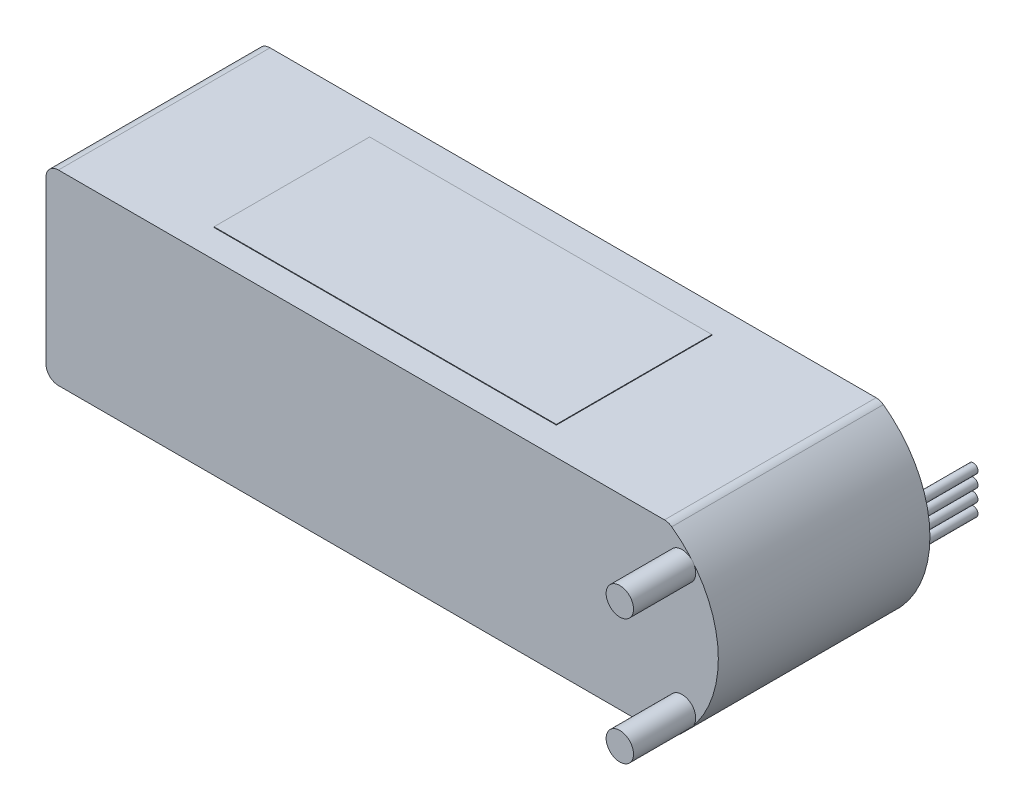
ISO-10303-21;
HEADER;
FILE_DESCRIPTION(('STEP AP214'),'2;1');
FILE_NAME('part.step','',(''),(''),'','','');
FILE_SCHEMA(('AUTOMOTIVE_DESIGN { 1 0 10303 214 1 1 1 1 }'));
ENDSEC;
DATA;
#1=APPLICATION_CONTEXT('core data for automotive mechanical design processes');
#2=APPLICATION_PROTOCOL_DEFINITION('international standard','automotive_design',2000,#1);
#3=PRODUCT_CONTEXT('',#1,'mechanical');
#4=PRODUCT('Part','Part','',(#3));
#5=PRODUCT_RELATED_PRODUCT_CATEGORY('part','',(#4));
#6=PRODUCT_DEFINITION_FORMATION('','',#4);
#7=PRODUCT_DEFINITION_CONTEXT('part definition',#1,'design');
#8=PRODUCT_DEFINITION('design','',#6,#7);
#9=PRODUCT_DEFINITION_SHAPE('','',#8);
#10=(LENGTH_UNIT() NAMED_UNIT(*) SI_UNIT(.MILLI.,.METRE.));
#11=(NAMED_UNIT(*) PLANE_ANGLE_UNIT() SI_UNIT($,.RADIAN.));
#12=(NAMED_UNIT(*) SI_UNIT($,.STERADIAN.) SOLID_ANGLE_UNIT());
#13=UNCERTAINTY_MEASURE_WITH_UNIT(LENGTH_MEASURE(1.E-05),#10,'distance_accuracy_value','');
#14=(GEOMETRIC_REPRESENTATION_CONTEXT(3) GLOBAL_UNCERTAINTY_ASSIGNED_CONTEXT((#13)) GLOBAL_UNIT_ASSIGNED_CONTEXT((#10,
#11,#12)) REPRESENTATION_CONTEXT('',''));
#15=CARTESIAN_POINT('',(0.,0.,0.));
#16=DIRECTION('',(0.,0.,1.));
#17=DIRECTION('',(1.,0.,0.));
#18=AXIS2_PLACEMENT_3D('',#15,#16,#17);
#19=CARTESIAN_POINT('',(55.,-3.00000000000001,-27.));
#20=DIRECTION('',(0.,0.,1.));
#21=DIRECTION('',(1.,0.,0.));
#22=AXIS2_PLACEMENT_3D('',#19,#20,#21);
#23=CYLINDRICAL_SURFACE('',#22,0.749999999999999);
#24=CARTESIAN_POINT('',(55.,-3.00000000000001,-27.));
#25=DIRECTION('',(0.,0.,-1.));
#26=DIRECTION('',(1.,0.,0.));
#27=AXIS2_PLACEMENT_3D('',#24,#25,#26);
#28=CIRCLE('',#27,0.749999999999999);
#29=CARTESIAN_POINT('',(55.75,-3.00000000000001,-27.));
#30=VERTEX_POINT('',#29);
#31=EDGE_CURVE('E11',#30,#30,#28,.T.);
#32=ORIENTED_EDGE('',*,*,#31,.F.);
#33=EDGE_LOOP('',(#32));
#34=FACE_BOUND('',#33,.T.);
#35=CARTESIAN_POINT('',(55.,-3.00000000000001,-17.));
#36=DIRECTION('',(0.,0.,-1.));
#37=DIRECTION('',(1.,0.,0.));
#38=AXIS2_PLACEMENT_3D('',#35,#36,#37);
#39=CIRCLE('',#38,0.749999999999999);
#40=CARTESIAN_POINT('',(55.75,-3.00000000000001,-17.));
#41=VERTEX_POINT('',#40);
#42=EDGE_CURVE('E46',#41,#41,#39,.T.);
#43=ORIENTED_EDGE('',*,*,#42,.T.);
#44=EDGE_LOOP('',(#43));
#45=FACE_BOUND('',#44,.T.);
#46=ADVANCED_FACE('F43',(#34,#45),#23,.T.);
#47=CARTESIAN_POINT('',(55.,-3.00000000000001,-27.));
#48=DIRECTION('',(0.,0.,1.));
#49=DIRECTION('',(1.,0.,0.));
#50=AXIS2_PLACEMENT_3D('',#47,#48,#49);
#51=PLANE('',#50);
#52=ORIENTED_EDGE('',*,*,#31,.T.);
#53=EDGE_LOOP('',(#52));
#54=FACE_BOUND('',#53,.T.);
#55=ADVANCED_FACE('F58',(#54),#51,.F.);
#56=CARTESIAN_POINT('',(55.,-3.00000000000001,-17.));
#57=DIRECTION('',(0.,0.,1.));
#58=DIRECTION('',(1.,0.,0.));
#59=AXIS2_PLACEMENT_3D('',#56,#57,#58);
#60=PLANE('',#59);
#61=ORIENTED_EDGE('',*,*,#42,.F.);
#62=EDGE_LOOP('',(#61));
#63=FACE_BOUND('',#62,.T.);
#64=ADVANCED_FACE('F56',(#63),#60,.T.);
#65=CLOSED_SHELL('',(#46,#55,#64));
#66=MANIFOLD_SOLID_BREP('B2',#65);
#67=CARTESIAN_POINT('',(55.,0.999999999999992,-27.));
#68=DIRECTION('',(0.,0.,1.));
#69=DIRECTION('',(1.,0.,0.));
#70=AXIS2_PLACEMENT_3D('',#67,#68,#69);
#71=CYLINDRICAL_SURFACE('',#70,0.749999999999999);
#72=CARTESIAN_POINT('',(55.,0.999999999999992,-27.));
#73=DIRECTION('',(0.,0.,-1.));
#74=DIRECTION('',(-1.,0.,0.));
#75=AXIS2_PLACEMENT_3D('',#72,#73,#74);
#76=CIRCLE('',#75,0.749999999999999);
#77=CARTESIAN_POINT('',(54.25,0.999999999999992,-27.));
#78=VERTEX_POINT('',#77);
#79=EDGE_CURVE('E42',#78,#78,#76,.T.);
#80=ORIENTED_EDGE('',*,*,#79,.F.);
#81=EDGE_LOOP('',(#80));
#82=FACE_BOUND('',#81,.T.);
#83=CARTESIAN_POINT('',(55.,0.999999999999992,-17.));
#84=DIRECTION('',(0.,0.,-1.));
#85=DIRECTION('',(-1.,0.,0.));
#86=AXIS2_PLACEMENT_3D('',#83,#84,#85);
#87=CIRCLE('',#86,0.749999999999999);
#88=CARTESIAN_POINT('',(54.25,0.999999999999992,-17.));
#89=VERTEX_POINT('',#88);
#90=EDGE_CURVE('E113',#89,#89,#87,.T.);
#91=ORIENTED_EDGE('',*,*,#90,.T.);
#92=EDGE_LOOP('',(#91));
#93=FACE_BOUND('',#92,.T.);
#94=ADVANCED_FACE('F110',(#82,#93),#71,.T.);
#95=CARTESIAN_POINT('',(55.,0.999999999999992,-27.));
#96=DIRECTION('',(0.,0.,-1.));
#97=DIRECTION('',(-1.,0.,0.));
#98=AXIS2_PLACEMENT_3D('',#95,#96,#97);
#99=PLANE('',#98);
#100=ORIENTED_EDGE('',*,*,#79,.T.);
#101=EDGE_LOOP('',(#100));
#102=FACE_BOUND('',#101,.T.);
#103=ADVANCED_FACE('F125',(#102),#99,.T.);
#104=CARTESIAN_POINT('',(55.,0.999999999999992,-17.));
#105=DIRECTION('',(0.,0.,-1.));
#106=DIRECTION('',(-1.,0.,0.));
#107=AXIS2_PLACEMENT_3D('',#104,#105,#106);
#108=PLANE('',#107);
#109=ORIENTED_EDGE('',*,*,#90,.F.);
#110=EDGE_LOOP('',(#109));
#111=FACE_BOUND('',#110,.T.);
#112=ADVANCED_FACE('F123',(#111),#108,.F.);
#113=CLOSED_SHELL('',(#94,#103,#112));
#114=MANIFOLD_SOLID_BREP('B6',#113);
#115=CARTESIAN_POINT('',(55.,-1.00000000000001,-27.));
#116=DIRECTION('',(0.,0.,1.));
#117=DIRECTION('',(1.,0.,0.));
#118=AXIS2_PLACEMENT_3D('',#115,#116,#117);
#119=CYLINDRICAL_SURFACE('',#118,0.749999999999999);
#120=CARTESIAN_POINT('',(55.,-1.00000000000001,-27.));
#121=DIRECTION('',(0.,0.,-1.));
#122=DIRECTION('',(1.,0.,0.));
#123=AXIS2_PLACEMENT_3D('',#120,#121,#122);
#124=CIRCLE('',#123,0.749999999999999);
#125=CARTESIAN_POINT('',(55.75,-1.00000000000001,-27.));
#126=VERTEX_POINT('',#125);
#127=EDGE_CURVE('E109',#126,#126,#124,.T.);
#128=ORIENTED_EDGE('',*,*,#127,.F.);
#129=EDGE_LOOP('',(#128));
#130=FACE_BOUND('',#129,.T.);
#131=CARTESIAN_POINT('',(55.,-1.00000000000001,-17.));
#132=DIRECTION('',(0.,0.,-1.));
#133=DIRECTION('',(1.,0.,0.));
#134=AXIS2_PLACEMENT_3D('',#131,#132,#133);
#135=CIRCLE('',#134,0.749999999999999);
#136=CARTESIAN_POINT('',(55.75,-1.00000000000001,-17.));
#137=VERTEX_POINT('',#136);
#138=EDGE_CURVE('E180',#137,#137,#135,.T.);
#139=ORIENTED_EDGE('',*,*,#138,.T.);
#140=EDGE_LOOP('',(#139));
#141=FACE_BOUND('',#140,.T.);
#142=ADVANCED_FACE('F177',(#130,#141),#119,.T.);
#143=CARTESIAN_POINT('',(55.,-1.00000000000001,-27.));
#144=DIRECTION('',(0.,0.,1.));
#145=DIRECTION('',(1.,0.,0.));
#146=AXIS2_PLACEMENT_3D('',#143,#144,#145);
#147=PLANE('',#146);
#148=ORIENTED_EDGE('',*,*,#127,.T.);
#149=EDGE_LOOP('',(#148));
#150=FACE_BOUND('',#149,.T.);
#151=ADVANCED_FACE('F192',(#150),#147,.F.);
#152=CARTESIAN_POINT('',(55.,-1.00000000000001,-17.));
#153=DIRECTION('',(0.,0.,1.));
#154=DIRECTION('',(1.,0.,0.));
#155=AXIS2_PLACEMENT_3D('',#152,#153,#154);
#156=PLANE('',#155);
#157=ORIENTED_EDGE('',*,*,#138,.F.);
#158=EDGE_LOOP('',(#157));
#159=FACE_BOUND('',#158,.T.);
#160=ADVANCED_FACE('F190',(#159),#156,.T.);
#161=CLOSED_SHELL('',(#142,#151,#160));
#162=MANIFOLD_SOLID_BREP('B37',#161);
#163=CARTESIAN_POINT('',(55.,2.99999999999999,-27.));
#164=DIRECTION('',(0.,0.,1.));
#165=DIRECTION('',(1.,0.,0.));
#166=AXIS2_PLACEMENT_3D('',#163,#164,#165);
#167=CYLINDRICAL_SURFACE('',#166,0.749999999999999);
#168=CARTESIAN_POINT('',(55.,2.99999999999999,-27.));
#169=DIRECTION('',(0.,0.,-1.));
#170=DIRECTION('',(-1.,0.,0.));
#171=AXIS2_PLACEMENT_3D('',#168,#169,#170);
#172=CIRCLE('',#171,0.749999999999999);
#173=CARTESIAN_POINT('',(54.25,2.99999999999999,-27.));
#174=VERTEX_POINT('',#173);
#175=EDGE_CURVE('E176',#174,#174,#172,.T.);
#176=ORIENTED_EDGE('',*,*,#175,.F.);
#177=EDGE_LOOP('',(#176));
#178=FACE_BOUND('',#177,.T.);
#179=CARTESIAN_POINT('',(55.,2.99999999999999,-17.));
#180=DIRECTION('',(0.,0.,-1.));
#181=DIRECTION('',(-1.,0.,0.));
#182=AXIS2_PLACEMENT_3D('',#179,#180,#181);
#183=CIRCLE('',#182,0.749999999999999);
#184=CARTESIAN_POINT('',(54.25,2.99999999999999,-17.));
#185=VERTEX_POINT('',#184);
#186=EDGE_CURVE('E247',#185,#185,#183,.T.);
#187=ORIENTED_EDGE('',*,*,#186,.T.);
#188=EDGE_LOOP('',(#187));
#189=FACE_BOUND('',#188,.T.);
#190=ADVANCED_FACE('F244',(#178,#189),#167,.T.);
#191=CARTESIAN_POINT('',(55.,2.99999999999999,-27.));
#192=DIRECTION('',(0.,0.,-1.));
#193=DIRECTION('',(-1.,0.,0.));
#194=AXIS2_PLACEMENT_3D('',#191,#192,#193);
#195=PLANE('',#194);
#196=ORIENTED_EDGE('',*,*,#175,.T.);
#197=EDGE_LOOP('',(#196));
#198=FACE_BOUND('',#197,.T.);
#199=ADVANCED_FACE('F259',(#198),#195,.T.);
#200=CARTESIAN_POINT('',(55.,2.99999999999999,-17.));
#201=DIRECTION('',(0.,0.,-1.));
#202=DIRECTION('',(-1.,0.,0.));
#203=AXIS2_PLACEMENT_3D('',#200,#201,#202);
#204=PLANE('',#203);
#205=ORIENTED_EDGE('',*,*,#186,.F.);
#206=EDGE_LOOP('',(#205));
#207=FACE_BOUND('',#206,.T.);
#208=ADVANCED_FACE('F257',(#207),#204,.F.);
#209=CLOSED_SHELL('',(#190,#199,#208));
#210=MANIFOLD_SOLID_BREP('B104',#209);
#211=CARTESIAN_POINT('',(52.2,-10.0835446118809,27.));
#212=DIRECTION('',(0.,0.,-1.));
#213=DIRECTION('',(-1.,0.,0.));
#214=AXIS2_PLACEMENT_3D('',#211,#212,#213);
#215=CYLINDRICAL_SURFACE('',#214,2.2);
#216=CARTESIAN_POINT('',(52.2,-10.0835446118809,27.));
#217=DIRECTION('',(0.,0.,1.));
#218=DIRECTION('',(-1.,0.,0.));
#219=AXIS2_PLACEMENT_3D('',#216,#217,#218);
#220=CIRCLE('',#219,2.2);
#221=CARTESIAN_POINT('',(50.,-10.0835446118809,27.));
#222=VERTEX_POINT('',#221);
#223=EDGE_CURVE('E243',#222,#222,#220,.T.);
#224=ORIENTED_EDGE('',*,*,#223,.F.);
#225=EDGE_LOOP('',(#224));
#226=FACE_BOUND('',#225,.T.);
#227=CARTESIAN_POINT('',(52.2,-10.0835446118809,17.));
#228=DIRECTION('',(0.,0.,1.));
#229=DIRECTION('',(-1.,0.,0.));
#230=AXIS2_PLACEMENT_3D('',#227,#228,#229);
#231=CIRCLE('',#230,2.2);
#232=CARTESIAN_POINT('',(50.,-10.0835446118809,17.));
#233=VERTEX_POINT('',#232);
#234=EDGE_CURVE('E314',#233,#233,#231,.T.);
#235=ORIENTED_EDGE('',*,*,#234,.T.);
#236=EDGE_LOOP('',(#235));
#237=FACE_BOUND('',#236,.T.);
#238=ADVANCED_FACE('F311',(#226,#237),#215,.T.);
#239=CARTESIAN_POINT('',(52.2,-10.0835446118809,27.));
#240=DIRECTION('',(0.,0.,-1.));
#241=DIRECTION('',(-1.,0.,0.));
#242=AXIS2_PLACEMENT_3D('',#239,#240,#241);
#243=PLANE('',#242);
#244=ORIENTED_EDGE('',*,*,#223,.T.);
#245=EDGE_LOOP('',(#244));
#246=FACE_BOUND('',#245,.T.);
#247=ADVANCED_FACE('F326',(#246),#243,.F.);
#248=CARTESIAN_POINT('',(52.2,-10.0835446118809,17.));
#249=DIRECTION('',(0.,0.,-1.));
#250=DIRECTION('',(-1.,0.,0.));
#251=AXIS2_PLACEMENT_3D('',#248,#249,#250);
#252=PLANE('',#251);
#253=ORIENTED_EDGE('',*,*,#234,.F.);
#254=EDGE_LOOP('',(#253));
#255=FACE_BOUND('',#254,.T.);
#256=ADVANCED_FACE('F324',(#255),#252,.T.);
#257=CLOSED_SHELL('',(#238,#247,#256));
#258=MANIFOLD_SOLID_BREP('B171',#257);
#259=CARTESIAN_POINT('',(52.2,10.0835446118809,27.));
#260=DIRECTION('',(0.,0.,-1.));
#261=DIRECTION('',(-1.,0.,0.));
#262=AXIS2_PLACEMENT_3D('',#259,#260,#261);
#263=CYLINDRICAL_SURFACE('',#262,2.2);
#264=CARTESIAN_POINT('',(52.2,10.0835446118809,27.));
#265=DIRECTION('',(0.,0.,1.));
#266=DIRECTION('',(1.,0.,0.));
#267=AXIS2_PLACEMENT_3D('',#264,#265,#266);
#268=CIRCLE('',#267,2.2);
#269=CARTESIAN_POINT('',(54.4,10.0835446118809,27.));
#270=VERTEX_POINT('',#269);
#271=EDGE_CURVE('E310',#270,#270,#268,.T.);
#272=ORIENTED_EDGE('',*,*,#271,.F.);
#273=EDGE_LOOP('',(#272));
#274=FACE_BOUND('',#273,.T.);
#275=CARTESIAN_POINT('',(52.2,10.0835446118809,17.));
#276=DIRECTION('',(0.,0.,1.));
#277=DIRECTION('',(1.,0.,0.));
#278=AXIS2_PLACEMENT_3D('',#275,#276,#277);
#279=CIRCLE('',#278,2.2);
#280=CARTESIAN_POINT('',(54.4,10.0835446118809,17.));
#281=VERTEX_POINT('',#280);
#282=EDGE_CURVE('E382',#281,#281,#279,.T.);
#283=ORIENTED_EDGE('',*,*,#282,.T.);
#284=EDGE_LOOP('',(#283));
#285=FACE_BOUND('',#284,.T.);
#286=ADVANCED_FACE('F379',(#274,#285),#263,.T.);
#287=CARTESIAN_POINT('',(52.2,10.0835446118809,27.));
#288=DIRECTION('',(0.,0.,1.));
#289=DIRECTION('',(1.,0.,0.));
#290=AXIS2_PLACEMENT_3D('',#287,#288,#289);
#291=PLANE('',#290);
#292=ORIENTED_EDGE('',*,*,#271,.T.);
#293=EDGE_LOOP('',(#292));
#294=FACE_BOUND('',#293,.T.);
#295=ADVANCED_FACE('F394',(#294),#291,.T.);
#296=CARTESIAN_POINT('',(52.2,10.0835446118809,17.));
#297=DIRECTION('',(0.,0.,1.));
#298=DIRECTION('',(1.,0.,0.));
#299=AXIS2_PLACEMENT_3D('',#296,#297,#298);
#300=PLANE('',#299);
#301=ORIENTED_EDGE('',*,*,#282,.F.);
#302=EDGE_LOOP('',(#301));
#303=FACE_BOUND('',#302,.T.);
#304=ADVANCED_FACE('F392',(#303),#300,.F.);
#305=CLOSED_SHELL('',(#286,#295,#304));
#306=MANIFOLD_SOLID_BREP('B238',#305);
#307=CARTESIAN_POINT('',(-50.,15.,17.));
#308=DIRECTION('',(0.,-1.,0.));
#309=DIRECTION('',(0.,0.,-1.));
#310=AXIS2_PLACEMENT_3D('',#307,#308,#309);
#311=PLANE('',#310);
#312=DIRECTION('',(-1.,0.,0.));
#313=VECTOR('',#312,1.);
#314=CARTESIAN_POINT('',(-50.,15.,17.));
#315=LINE('',#314,#313);
#316=CARTESIAN_POINT('',(49.3749119724252,15.,17.));
#317=VERTEX_POINT('',#316);
#318=CARTESIAN_POINT('',(-48.,15.,17.));
#319=VERTEX_POINT('',#318);
#320=EDGE_CURVE('E564',#317,#319,#315,.T.);
#321=ORIENTED_EDGE('',*,*,#320,.F.);
#322=DIRECTION('',(0.,0.,-1.));
#323=VECTOR('',#322,1.);
#324=CARTESIAN_POINT('',(49.3749119724252,15.,17.));
#325=LINE('',#324,#323);
#326=CARTESIAN_POINT('',(49.3749119724252,15.,-17.));
#327=VERTEX_POINT('',#326);
#328=EDGE_CURVE('E605',#317,#327,#325,.T.);
#329=ORIENTED_EDGE('',*,*,#328,.T.);
#330=DIRECTION('',(-1.,0.,0.));
#331=VECTOR('',#330,1.);
#332=CARTESIAN_POINT('',(-50.,15.,-17.));
#333=LINE('',#332,#331);
#334=CARTESIAN_POINT('',(-48.,15.,-17.));
#335=VERTEX_POINT('',#334);
#336=EDGE_CURVE('E555',#327,#335,#333,.T.);
#337=ORIENTED_EDGE('',*,*,#336,.T.);
#338=DIRECTION('',(0.,0.,-1.));
#339=VECTOR('',#338,1.);
#340=CARTESIAN_POINT('',(-48.,15.,17.));
#341=LINE('',#340,#339);
#342=EDGE_CURVE('E603',#335,#319,#341,.F.);
#343=ORIENTED_EDGE('',*,*,#342,.T.);
#344=EDGE_LOOP('',(#321,#329,#337,#343));
#345=FACE_BOUND('',#344,.T.);
#346=DIRECTION('',(0.,0.,-1.));
#347=VECTOR('',#346,1.);
#348=CARTESIAN_POINT('',(27.5,15.,-12.5));
#349=LINE('',#348,#347);
#350=CARTESIAN_POINT('',(27.5,15.,12.5));
#351=VERTEX_POINT('',#350);
#352=CARTESIAN_POINT('',(27.5,15.,-12.5));
#353=VERTEX_POINT('',#352);
#354=EDGE_CURVE('E551',#351,#353,#349,.T.);
#355=ORIENTED_EDGE('',*,*,#354,.F.);
#356=DIRECTION('',(1.,0.,0.));
#357=VECTOR('',#356,1.);
#358=CARTESIAN_POINT('',(-27.5,15.,12.5));
#359=LINE('',#358,#357);
#360=CARTESIAN_POINT('',(-27.5,15.,12.5));
#361=VERTEX_POINT('',#360);
#362=EDGE_CURVE('E548',#361,#351,#359,.T.);
#363=ORIENTED_EDGE('',*,*,#362,.F.);
#364=DIRECTION('',(0.,0.,1.));
#365=VECTOR('',#364,1.);
#366=CARTESIAN_POINT('',(-27.5,15.,-12.5));
#367=LINE('',#366,#365);
#368=CARTESIAN_POINT('',(-27.5,15.,-12.5));
#369=VERTEX_POINT('',#368);
#370=EDGE_CURVE('E796',#369,#361,#367,.T.);
#371=ORIENTED_EDGE('',*,*,#370,.F.);
#372=DIRECTION('',(-1.,0.,0.));
#373=VECTOR('',#372,1.);
#374=CARTESIAN_POINT('',(-27.5,15.,-12.5));
#375=LINE('',#374,#373);
#376=EDGE_CURVE('E798',#353,#369,#375,.T.);
#377=ORIENTED_EDGE('',*,*,#376,.F.);
#378=EDGE_LOOP('',(#355,#363,#371,#377));
#379=FACE_BOUND('',#378,.T.);
#380=ADVANCED_FACE('F438',(#345,#379),#311,.F.);
#381=CARTESIAN_POINT('',(40.,0.,17.));
#382=DIRECTION('',(0.,0.,-1.));
#383=DIRECTION('',(-1.,0.,0.));
#384=AXIS2_PLACEMENT_3D('',#381,#382,#383);
#385=CYLINDRICAL_SURFACE('',#384,18.02775637732);
#386=CARTESIAN_POINT('',(40.,0.,17.));
#387=DIRECTION('',(0.,0.,1.));
#388=DIRECTION('',(1.,0.,0.));
#389=AXIS2_PLACEMENT_3D('',#386,#387,#388);
#390=CIRCLE('',#389,18.02775637732);
#391=CARTESIAN_POINT('',(50.5447465708211,-14.6221858747985,17.));
#392=VERTEX_POINT('',#391);
#393=CARTESIAN_POINT('',(50.5447465708211,14.6221858747985,17.));
#394=VERTEX_POINT('',#393);
#395=EDGE_CURVE('E561',#392,#394,#390,.T.);
#396=ORIENTED_EDGE('',*,*,#395,.F.);
#397=DIRECTION('',(0.,0.,-1.));
#398=VECTOR('',#397,1.);
#399=CARTESIAN_POINT('',(50.5447465708211,-14.6221858747985,17.));
#400=LINE('',#399,#398);
#401=CARTESIAN_POINT('',(50.5447465708211,-14.6221858747985,-17.));
#402=VERTEX_POINT('',#401);
#403=EDGE_CURVE('E580',#392,#402,#400,.T.);
#404=ORIENTED_EDGE('',*,*,#403,.T.);
#405=CARTESIAN_POINT('',(40.,0.,-17.));
#406=DIRECTION('',(0.,0.,1.));
#407=DIRECTION('',(1.,0.,0.));
#408=AXIS2_PLACEMENT_3D('',#405,#406,#407);
#409=CIRCLE('',#408,18.02775637732);
#410=CARTESIAN_POINT('',(50.5447465708211,14.6221858747985,-17.));
#411=VERTEX_POINT('',#410);
#412=EDGE_CURVE('E552',#402,#411,#409,.T.);
#413=ORIENTED_EDGE('',*,*,#412,.T.);
#414=DIRECTION('',(0.,0.,-1.));
#415=VECTOR('',#414,1.);
#416=CARTESIAN_POINT('',(50.5447465708211,14.6221858747985,17.));
#417=LINE('',#416,#415);
#418=EDGE_CURVE('E571',#411,#394,#417,.F.);
#419=ORIENTED_EDGE('',*,*,#418,.T.);
#420=EDGE_LOOP('',(#396,#404,#413,#419));
#421=FACE_BOUND('',#420,.T.);
#422=ADVANCED_FACE('F632',(#421),#385,.T.);
#423=CARTESIAN_POINT('',(-50.,15.,17.));
#424=DIRECTION('',(1.,0.,0.));
#425=DIRECTION('',(0.,1.,0.));
#426=AXIS2_PLACEMENT_3D('',#423,#424,#425);
#427=PLANE('',#426);
#428=DIRECTION('',(0.,-1.,0.));
#429=VECTOR('',#428,1.);
#430=CARTESIAN_POINT('',(-50.,15.,-17.));
#431=LINE('',#430,#429);
#432=CARTESIAN_POINT('',(-50.,13.,-17.));
#433=VERTEX_POINT('',#432);
#434=CARTESIAN_POINT('',(-50.,-13.,-17.));
#435=VERTEX_POINT('',#434);
#436=EDGE_CURVE('E575',#433,#435,#431,.T.);
#437=ORIENTED_EDGE('',*,*,#436,.T.);
#438=DIRECTION('',(0.,0.,-1.));
#439=VECTOR('',#438,1.);
#440=CARTESIAN_POINT('',(-50.,-13.,17.));
#441=LINE('',#440,#439);
#442=CARTESIAN_POINT('',(-50.,-13.,17.));
#443=VERTEX_POINT('',#442);
#444=EDGE_CURVE('E377',#435,#443,#441,.F.);
#445=ORIENTED_EDGE('',*,*,#444,.T.);
#446=DIRECTION('',(0.,-1.,0.));
#447=VECTOR('',#446,1.);
#448=CARTESIAN_POINT('',(-50.,15.,17.));
#449=LINE('',#448,#447);
#450=CARTESIAN_POINT('',(-50.,13.,17.));
#451=VERTEX_POINT('',#450);
#452=EDGE_CURVE('E567',#451,#443,#449,.T.);
#453=ORIENTED_EDGE('',*,*,#452,.F.);
#454=DIRECTION('',(0.,0.,-1.));
#455=VECTOR('',#454,1.);
#456=CARTESIAN_POINT('',(-50.,13.,17.));
#457=LINE('',#456,#455);
#458=EDGE_CURVE('E446',#451,#433,#457,.T.);
#459=ORIENTED_EDGE('',*,*,#458,.T.);
#460=EDGE_LOOP('',(#437,#445,#453,#459));
#461=FACE_BOUND('',#460,.T.);
#462=ADVANCED_FACE('F610',(#461),#427,.F.);
#463=CARTESIAN_POINT('',(-50.,-15.,17.));
#464=DIRECTION('',(0.,1.,0.));
#465=DIRECTION('',(0.,0.,1.));
#466=AXIS2_PLACEMENT_3D('',#463,#464,#465);
#467=PLANE('',#466);
#468=DIRECTION('',(1.,0.,0.));
#469=VECTOR('',#468,1.);
#470=CARTESIAN_POINT('',(-50.,-15.,-17.));
#471=LINE('',#470,#469);
#472=CARTESIAN_POINT('',(-48.,-15.,-17.));
#473=VERTEX_POINT('',#472);
#474=CARTESIAN_POINT('',(49.3749119724252,-15.,-17.));
#475=VERTEX_POINT('',#474);
#476=EDGE_CURVE('E565',#473,#475,#471,.T.);
#477=ORIENTED_EDGE('',*,*,#476,.T.);
#478=DIRECTION('',(0.,0.,-1.));
#479=VECTOR('',#478,1.);
#480=CARTESIAN_POINT('',(49.3749119724252,-15.,17.));
#481=LINE('',#480,#479);
#482=CARTESIAN_POINT('',(49.3749119724252,-15.,17.));
#483=VERTEX_POINT('',#482);
#484=EDGE_CURVE('E594',#475,#483,#481,.F.);
#485=ORIENTED_EDGE('',*,*,#484,.T.);
#486=DIRECTION('',(1.,0.,0.));
#487=VECTOR('',#486,1.);
#488=CARTESIAN_POINT('',(-50.,-15.,17.));
#489=LINE('',#488,#487);
#490=CARTESIAN_POINT('',(-48.,-15.,17.));
#491=VERTEX_POINT('',#490);
#492=EDGE_CURVE('E569',#491,#483,#489,.T.);
#493=ORIENTED_EDGE('',*,*,#492,.F.);
#494=DIRECTION('',(0.,0.,-1.));
#495=VECTOR('',#494,1.);
#496=CARTESIAN_POINT('',(-48.,-15.,17.));
#497=LINE('',#496,#495);
#498=EDGE_CURVE('E591',#491,#473,#497,.T.);
#499=ORIENTED_EDGE('',*,*,#498,.T.);
#500=EDGE_LOOP('',(#477,#485,#493,#499));
#501=FACE_BOUND('',#500,.T.);
#502=ADVANCED_FACE('F623',(#501),#467,.F.);
#503=CARTESIAN_POINT('',(40.,0.,17.));
#504=DIRECTION('',(0.,0.,1.));
#505=DIRECTION('',(1.,0.,0.));
#506=AXIS2_PLACEMENT_3D('',#503,#504,#505);
#507=PLANE('',#506);
#508=ORIENTED_EDGE('',*,*,#492,.T.);
#509=CARTESIAN_POINT('',(49.3749119724252,-13.,17.));
#510=DIRECTION('',(0.,0.,1.));
#511=DIRECTION('',(1.,0.,0.));
#512=AXIS2_PLACEMENT_3D('',#509,#510,#511);
#513=CIRCLE('',#512,2.);
#514=EDGE_CURVE('E601',#483,#392,#513,.T.);
#515=ORIENTED_EDGE('',*,*,#514,.T.);
#516=ORIENTED_EDGE('',*,*,#395,.T.);
#517=CARTESIAN_POINT('',(49.3749119724252,13.,17.));
#518=DIRECTION('',(0.,0.,1.));
#519=DIRECTION('',(1.,0.,0.));
#520=AXIS2_PLACEMENT_3D('',#517,#518,#519);
#521=CIRCLE('',#520,2.);
#522=EDGE_CURVE('E599',#394,#317,#521,.T.);
#523=ORIENTED_EDGE('',*,*,#522,.T.);
#524=ORIENTED_EDGE('',*,*,#320,.T.);
#525=CARTESIAN_POINT('',(-48.,13.,17.));
#526=DIRECTION('',(0.,0.,1.));
#527=DIRECTION('',(1.,0.,0.));
#528=AXIS2_PLACEMENT_3D('',#525,#526,#527);
#529=CIRCLE('',#528,2.);
#530=EDGE_CURVE('E458',#319,#451,#529,.T.);
#531=ORIENTED_EDGE('',*,*,#530,.T.);
#532=ORIENTED_EDGE('',*,*,#452,.T.);
#533=CARTESIAN_POINT('',(-48.,-13.,17.));
#534=DIRECTION('',(0.,0.,1.));
#535=DIRECTION('',(1.,0.,0.));
#536=AXIS2_PLACEMENT_3D('',#533,#534,#535);
#537=CIRCLE('',#536,2.);
#538=EDGE_CURVE('E597',#443,#491,#537,.T.);
#539=ORIENTED_EDGE('',*,*,#538,.T.);
#540=EDGE_LOOP('',(#508,#515,#516,#523,#524,#531,#532,#539));
#541=FACE_BOUND('',#540,.T.);
#542=ADVANCED_FACE('F626',(#541),#507,.T.);
#543=CARTESIAN_POINT('',(40.,0.,-17.));
#544=DIRECTION('',(0.,0.,1.));
#545=DIRECTION('',(1.,0.,0.));
#546=AXIS2_PLACEMENT_3D('',#543,#544,#545);
#547=PLANE('',#546);
#548=ORIENTED_EDGE('',*,*,#412,.F.);
#549=CARTESIAN_POINT('',(49.3749119724252,-13.,-17.));
#550=DIRECTION('',(0.,0.,1.));
#551=DIRECTION('',(1.,0.,0.));
#552=AXIS2_PLACEMENT_3D('',#549,#550,#551);
#553=CIRCLE('',#552,2.);
#554=EDGE_CURVE('E589',#402,#475,#553,.F.);
#555=ORIENTED_EDGE('',*,*,#554,.T.);
#556=ORIENTED_EDGE('',*,*,#476,.F.);
#557=CARTESIAN_POINT('',(-48.,-13.,-17.));
#558=DIRECTION('',(0.,0.,1.));
#559=DIRECTION('',(1.,0.,0.));
#560=AXIS2_PLACEMENT_3D('',#557,#558,#559);
#561=CIRCLE('',#560,2.);
#562=EDGE_CURVE('E585',#473,#435,#561,.F.);
#563=ORIENTED_EDGE('',*,*,#562,.T.);
#564=ORIENTED_EDGE('',*,*,#436,.F.);
#565=CARTESIAN_POINT('',(-48.,13.,-17.));
#566=DIRECTION('',(0.,0.,1.));
#567=DIRECTION('',(1.,0.,0.));
#568=AXIS2_PLACEMENT_3D('',#565,#566,#567);
#569=CIRCLE('',#568,2.);
#570=EDGE_CURVE('E583',#433,#335,#569,.F.);
#571=ORIENTED_EDGE('',*,*,#570,.T.);
#572=ORIENTED_EDGE('',*,*,#336,.F.);
#573=CARTESIAN_POINT('',(49.3749119724252,13.,-17.));
#574=DIRECTION('',(0.,0.,1.));
#575=DIRECTION('',(1.,0.,0.));
#576=AXIS2_PLACEMENT_3D('',#573,#574,#575);
#577=CIRCLE('',#576,2.);
#578=EDGE_CURVE('E587',#327,#411,#577,.F.);
#579=ORIENTED_EDGE('',*,*,#578,.T.);
#580=EDGE_LOOP('',(#548,#555,#556,#563,#564,#571,#572,#579));
#581=FACE_BOUND('',#580,.T.);
#582=ADVANCED_FACE('F614',(#581),#547,.F.);
#583=CARTESIAN_POINT('',(27.5,15.1,-12.5));
#584=DIRECTION('',(-1.,0.,0.));
#585=DIRECTION('',(0.,0.,1.));
#586=AXIS2_PLACEMENT_3D('',#583,#584,#585);
#587=PLANE('',#586);
#588=ORIENTED_EDGE('',*,*,#354,.T.);
#589=DIRECTION('',(0.,-1.,0.));
#590=VECTOR('',#589,1.);
#591=CARTESIAN_POINT('',(27.5,15.1,-12.5));
#592=LINE('',#591,#590);
#593=CARTESIAN_POINT('',(27.5,15.1,-12.5));
#594=VERTEX_POINT('',#593);
#595=EDGE_CURVE('E532',#594,#353,#592,.T.);
#596=ORIENTED_EDGE('',*,*,#595,.F.);
#597=DIRECTION('',(0.,0.,-1.));
#598=VECTOR('',#597,1.);
#599=CARTESIAN_POINT('',(27.5,15.1,-12.5));
#600=LINE('',#599,#598);
#601=CARTESIAN_POINT('',(27.5,15.1,12.5));
#602=VERTEX_POINT('',#601);
#603=EDGE_CURVE('E539',#602,#594,#600,.T.);
#604=ORIENTED_EDGE('',*,*,#603,.F.);
#605=DIRECTION('',(0.,-1.,0.));
#606=VECTOR('',#605,1.);
#607=CARTESIAN_POINT('',(27.5,15.1,12.5));
#608=LINE('',#607,#606);
#609=EDGE_CURVE('E801',#602,#351,#608,.T.);
#610=ORIENTED_EDGE('',*,*,#609,.T.);
#611=EDGE_LOOP('',(#588,#596,#604,#610));
#612=FACE_BOUND('',#611,.T.);
#613=ADVANCED_FACE('F550',(#612),#587,.F.);
#614=CARTESIAN_POINT('',(-27.5,15.1,-12.5));
#615=DIRECTION('',(0.,0.,1.));
#616=DIRECTION('',(1.,0.,0.));
#617=AXIS2_PLACEMENT_3D('',#614,#615,#616);
#618=PLANE('',#617);
#619=ORIENTED_EDGE('',*,*,#376,.T.);
#620=DIRECTION('',(0.,-1.,0.));
#621=VECTOR('',#620,1.);
#622=CARTESIAN_POINT('',(-27.5,15.1,-12.5));
#623=LINE('',#622,#621);
#624=CARTESIAN_POINT('',(-27.5,15.1,-12.5));
#625=VERTEX_POINT('',#624);
#626=EDGE_CURVE('E535',#625,#369,#623,.T.);
#627=ORIENTED_EDGE('',*,*,#626,.F.);
#628=DIRECTION('',(-1.,0.,0.));
#629=VECTOR('',#628,1.);
#630=CARTESIAN_POINT('',(-27.5,15.1,-12.5));
#631=LINE('',#630,#629);
#632=EDGE_CURVE('E527',#594,#625,#631,.T.);
#633=ORIENTED_EDGE('',*,*,#632,.F.);
#634=ORIENTED_EDGE('',*,*,#595,.T.);
#635=EDGE_LOOP('',(#619,#627,#633,#634));
#636=FACE_BOUND('',#635,.T.);
#637=ADVANCED_FACE('F530',(#636),#618,.F.);
#638=CARTESIAN_POINT('',(-27.5,15.1,-12.5));
#639=DIRECTION('',(1.,0.,0.));
#640=DIRECTION('',(0.,0.,-1.));
#641=AXIS2_PLACEMENT_3D('',#638,#639,#640);
#642=PLANE('',#641);
#643=ORIENTED_EDGE('',*,*,#370,.T.);
#644=DIRECTION('',(0.,-1.,0.));
#645=VECTOR('',#644,1.);
#646=CARTESIAN_POINT('',(-27.5,15.1,12.5));
#647=LINE('',#646,#645);
#648=CARTESIAN_POINT('',(-27.5,15.1,12.5));
#649=VERTEX_POINT('',#648);
#650=EDGE_CURVE('E557',#649,#361,#647,.T.);
#651=ORIENTED_EDGE('',*,*,#650,.F.);
#652=DIRECTION('',(0.,0.,1.));
#653=VECTOR('',#652,1.);
#654=CARTESIAN_POINT('',(-27.5,15.1,-12.5));
#655=LINE('',#654,#653);
#656=EDGE_CURVE('E538',#625,#649,#655,.T.);
#657=ORIENTED_EDGE('',*,*,#656,.F.);
#658=ORIENTED_EDGE('',*,*,#626,.T.);
#659=EDGE_LOOP('',(#643,#651,#657,#658));
#660=FACE_BOUND('',#659,.T.);
#661=ADVANCED_FACE('F689',(#660),#642,.F.);
#662=CARTESIAN_POINT('',(-27.5,15.1,12.5));
#663=DIRECTION('',(0.,0.,-1.));
#664=DIRECTION('',(-1.,0.,0.));
#665=AXIS2_PLACEMENT_3D('',#662,#663,#664);
#666=PLANE('',#665);
#667=ORIENTED_EDGE('',*,*,#362,.T.);
#668=ORIENTED_EDGE('',*,*,#609,.F.);
#669=DIRECTION('',(1.,0.,0.));
#670=VECTOR('',#669,1.);
#671=CARTESIAN_POINT('',(-27.5,15.1,12.5));
#672=LINE('',#671,#670);
#673=EDGE_CURVE('E544',#649,#602,#672,.T.);
#674=ORIENTED_EDGE('',*,*,#673,.F.);
#675=ORIENTED_EDGE('',*,*,#650,.T.);
#676=EDGE_LOOP('',(#667,#668,#674,#675));
#677=FACE_BOUND('',#676,.T.);
#678=ADVANCED_FACE('F678',(#677),#666,.F.);
#679=CARTESIAN_POINT('',(0.,15.1,0.));
#680=DIRECTION('',(0.,1.,0.));
#681=DIRECTION('',(0.,0.,1.));
#682=AXIS2_PLACEMENT_3D('',#679,#680,#681);
#683=PLANE('',#682);
#684=ORIENTED_EDGE('',*,*,#603,.T.);
#685=ORIENTED_EDGE('',*,*,#632,.T.);
#686=ORIENTED_EDGE('',*,*,#656,.T.);
#687=ORIENTED_EDGE('',*,*,#673,.T.);
#688=EDGE_LOOP('',(#684,#685,#686,#687));
#689=FACE_BOUND('',#688,.T.);
#690=ADVANCED_FACE('F542',(#689),#683,.T.);
#691=CARTESIAN_POINT('',(49.3749119724252,-13.,17.));
#692=DIRECTION('',(0.,0.,-1.));
#693=DIRECTION('',(-1.,0.,0.));
#694=AXIS2_PLACEMENT_3D('',#691,#692,#693);
#695=CYLINDRICAL_SURFACE('',#694,2.);
#696=ORIENTED_EDGE('',*,*,#514,.F.);
#697=ORIENTED_EDGE('',*,*,#484,.F.);
#698=ORIENTED_EDGE('',*,*,#554,.F.);
#699=ORIENTED_EDGE('',*,*,#403,.F.);
#700=EDGE_LOOP('',(#696,#697,#698,#699));
#701=FACE_BOUND('',#700,.T.);
#702=ADVANCED_FACE('F630',(#701),#695,.T.);
#703=CARTESIAN_POINT('',(49.3749119724252,13.,17.));
#704=DIRECTION('',(0.,0.,-1.));
#705=DIRECTION('',(-1.,0.,0.));
#706=AXIS2_PLACEMENT_3D('',#703,#704,#705);
#707=CYLINDRICAL_SURFACE('',#706,2.);
#708=ORIENTED_EDGE('',*,*,#522,.F.);
#709=ORIENTED_EDGE('',*,*,#418,.F.);
#710=ORIENTED_EDGE('',*,*,#578,.F.);
#711=ORIENTED_EDGE('',*,*,#328,.F.);
#712=EDGE_LOOP('',(#708,#709,#710,#711));
#713=FACE_BOUND('',#712,.T.);
#714=ADVANCED_FACE('F637',(#713),#707,.T.);
#715=CARTESIAN_POINT('',(-48.,-13.,17.));
#716=DIRECTION('',(0.,0.,-1.));
#717=DIRECTION('',(-1.,0.,0.));
#718=AXIS2_PLACEMENT_3D('',#715,#716,#717);
#719=CYLINDRICAL_SURFACE('',#718,2.);
#720=ORIENTED_EDGE('',*,*,#538,.F.);
#721=ORIENTED_EDGE('',*,*,#444,.F.);
#722=ORIENTED_EDGE('',*,*,#562,.F.);
#723=ORIENTED_EDGE('',*,*,#498,.F.);
#724=EDGE_LOOP('',(#720,#721,#722,#723));
#725=FACE_BOUND('',#724,.T.);
#726=ADVANCED_FACE('F620',(#725),#719,.T.);
#727=CARTESIAN_POINT('',(-48.,13.,17.));
#728=DIRECTION('',(0.,0.,-1.));
#729=DIRECTION('',(-1.,0.,0.));
#730=AXIS2_PLACEMENT_3D('',#727,#728,#729);
#731=CYLINDRICAL_SURFACE('',#730,2.);
#732=ORIENTED_EDGE('',*,*,#530,.F.);
#733=ORIENTED_EDGE('',*,*,#342,.F.);
#734=ORIENTED_EDGE('',*,*,#570,.F.);
#735=ORIENTED_EDGE('',*,*,#458,.F.);
#736=EDGE_LOOP('',(#732,#733,#734,#735));
#737=FACE_BOUND('',#736,.T.);
#738=ADVANCED_FACE('F440',(#737),#731,.T.);
#739=CLOSED_SHELL('',(#380,#422,#462,#502,#542,#582,#613,#637,#661,#678,#690,#702,#714,#726,#738));
#740=MANIFOLD_SOLID_BREP('B305',#739);
#741=ADVANCED_BREP_SHAPE_REPRESENTATION('',(#18,#66,#114,#162,#210,#258,#306,#740),#14);
#742=SHAPE_DEFINITION_REPRESENTATION(#9,#741);
ENDSEC;
END-ISO-10303-21;
